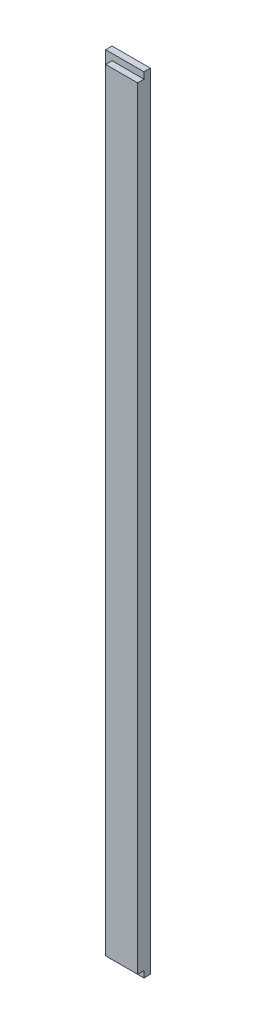
ISO-10303-21;
HEADER;
FILE_DESCRIPTION(('STEP AP214'),'2;1');
FILE_NAME('part.step','',(''),(''),'','','');
FILE_SCHEMA(('AUTOMOTIVE_DESIGN { 1 0 10303 214 1 1 1 1 }'));
ENDSEC;
DATA;
#1=APPLICATION_CONTEXT('core data for automotive mechanical design processes');
#2=APPLICATION_PROTOCOL_DEFINITION('international standard','automotive_design',2000,#1);
#3=PRODUCT_CONTEXT('',#1,'mechanical');
#4=PRODUCT('Part','Part','',(#3));
#5=PRODUCT_RELATED_PRODUCT_CATEGORY('part','',(#4));
#6=PRODUCT_DEFINITION_FORMATION('','',#4);
#7=PRODUCT_DEFINITION_CONTEXT('part definition',#1,'design');
#8=PRODUCT_DEFINITION('design','',#6,#7);
#9=PRODUCT_DEFINITION_SHAPE('','',#8);
#10=(LENGTH_UNIT() NAMED_UNIT(*) SI_UNIT(.MILLI.,.METRE.));
#11=(NAMED_UNIT(*) PLANE_ANGLE_UNIT() SI_UNIT($,.RADIAN.));
#12=(NAMED_UNIT(*) SI_UNIT($,.STERADIAN.) SOLID_ANGLE_UNIT());
#13=UNCERTAINTY_MEASURE_WITH_UNIT(LENGTH_MEASURE(1.E-05),#10,'distance_accuracy_value','');
#14=(GEOMETRIC_REPRESENTATION_CONTEXT(3) GLOBAL_UNCERTAINTY_ASSIGNED_CONTEXT((#13)) GLOBAL_UNIT_ASSIGNED_CONTEXT((#10,
#11,#12)) REPRESENTATION_CONTEXT('',''));
#15=CARTESIAN_POINT('',(0.,0.,0.));
#16=DIRECTION('',(0.,0.,1.));
#17=DIRECTION('',(1.,0.,0.));
#18=AXIS2_PLACEMENT_3D('',#15,#16,#17);
#19=CARTESIAN_POINT('',(-30.0000000000001,-615.,20.));
#20=DIRECTION('',(1.,0.,0.));
#21=DIRECTION('',(0.,0.,-1.));
#22=AXIS2_PLACEMENT_3D('',#19,#20,#21);
#23=PLANE('',#22);
#24=DIRECTION('',(0.,-1.,0.));
#25=VECTOR('',#24,1.);
#26=CARTESIAN_POINT('',(-30.0000000000001,615.,10.));
#27=LINE('',#26,#25);
#28=CARTESIAN_POINT('',(-30.0000000000001,615.,10.));
#29=VERTEX_POINT('',#28);
#30=CARTESIAN_POINT('',(-30.0000000000001,-615.,10.));
#31=VERTEX_POINT('',#30);
#32=EDGE_CURVE('E106',#29,#31,#27,.T.);
#33=ORIENTED_EDGE('',*,*,#32,.F.);
#34=DIRECTION('',(0.,0.,-1.));
#35=VECTOR('',#34,1.);
#36=CARTESIAN_POINT('',(-30.0000000000001,615.,20.));
#37=LINE('',#36,#35);
#38=CARTESIAN_POINT('',(-30.0000000000001,615.,0.));
#39=VERTEX_POINT('',#38);
#40=EDGE_CURVE('E61',#29,#39,#37,.T.);
#41=ORIENTED_EDGE('',*,*,#40,.T.);
#42=DIRECTION('',(0.,-1.,0.));
#43=VECTOR('',#42,1.);
#44=CARTESIAN_POINT('',(-30.0000000000001,-615.,0.));
#45=LINE('',#44,#43);
#46=CARTESIAN_POINT('',(-30.0000000000001,-615.,0.));
#47=VERTEX_POINT('',#46);
#48=EDGE_CURVE('E148',#39,#47,#45,.T.);
#49=ORIENTED_EDGE('',*,*,#48,.T.);
#50=DIRECTION('',(0.,0.,-1.));
#51=VECTOR('',#50,1.);
#52=CARTESIAN_POINT('',(-30.0000000000001,-615.,20.));
#53=LINE('',#52,#51);
#54=EDGE_CURVE('E11',#31,#47,#53,.T.);
#55=ORIENTED_EDGE('',*,*,#54,.F.);
#56=EDGE_LOOP('',(#33,#41,#49,#55));
#57=FACE_BOUND('',#56,.T.);
#58=ADVANCED_FACE('F39',(#57),#23,.F.);
#59=CARTESIAN_POINT('',(30.0000000000001,-615.,20.));
#60=DIRECTION('',(0.,1.,0.));
#61=DIRECTION('',(0.,0.,1.));
#62=AXIS2_PLACEMENT_3D('',#59,#60,#61);
#63=PLANE('',#62);
#64=DIRECTION('',(1.,0.,0.));
#65=VECTOR('',#64,1.);
#66=CARTESIAN_POINT('',(-30.0000000000001,-615.,10.));
#67=LINE('',#66,#65);
#68=CARTESIAN_POINT('',(30.0000000000001,-615.,10.));
#69=VERTEX_POINT('',#68);
#70=EDGE_CURVE('E117',#31,#69,#67,.T.);
#71=ORIENTED_EDGE('',*,*,#70,.F.);
#72=ORIENTED_EDGE('',*,*,#54,.T.);
#73=DIRECTION('',(1.,0.,0.));
#74=VECTOR('',#73,1.);
#75=CARTESIAN_POINT('',(30.0000000000001,-615.,0.));
#76=LINE('',#75,#74);
#77=CARTESIAN_POINT('',(30.0000000000001,-615.,0.));
#78=VERTEX_POINT('',#77);
#79=EDGE_CURVE('E145',#47,#78,#76,.T.);
#80=ORIENTED_EDGE('',*,*,#79,.T.);
#81=DIRECTION('',(0.,0.,-1.));
#82=VECTOR('',#81,1.);
#83=CARTESIAN_POINT('',(30.0000000000001,-615.,20.));
#84=LINE('',#83,#82);
#85=EDGE_CURVE('E46',#69,#78,#84,.T.);
#86=ORIENTED_EDGE('',*,*,#85,.F.);
#87=EDGE_LOOP('',(#71,#72,#80,#86));
#88=FACE_BOUND('',#87,.T.);
#89=ADVANCED_FACE('F146',(#88),#63,.F.);
#90=CARTESIAN_POINT('',(-30.0000000000001,615.,20.));
#91=DIRECTION('',(0.,-1.,0.));
#92=DIRECTION('',(0.,0.,-1.));
#93=AXIS2_PLACEMENT_3D('',#90,#91,#92);
#94=PLANE('',#93);
#95=DIRECTION('',(-1.,0.,0.));
#96=VECTOR('',#95,1.);
#97=CARTESIAN_POINT('',(30.0000000000001,615.,10.));
#98=LINE('',#97,#96);
#99=CARTESIAN_POINT('',(30.0000000000001,615.,10.));
#100=VERTEX_POINT('',#99);
#101=EDGE_CURVE('E104',#100,#29,#98,.T.);
#102=ORIENTED_EDGE('',*,*,#101,.F.);
#103=DIRECTION('',(0.,0.,-1.));
#104=VECTOR('',#103,1.);
#105=CARTESIAN_POINT('',(30.0000000000001,615.,20.));
#106=LINE('',#105,#104);
#107=CARTESIAN_POINT('',(30.0000000000001,615.,0.));
#108=VERTEX_POINT('',#107);
#109=EDGE_CURVE('E123',#100,#108,#106,.T.);
#110=ORIENTED_EDGE('',*,*,#109,.T.);
#111=DIRECTION('',(-1.,0.,0.));
#112=VECTOR('',#111,1.);
#113=CARTESIAN_POINT('',(-30.0000000000001,615.,0.));
#114=LINE('',#113,#112);
#115=EDGE_CURVE('E121',#108,#39,#114,.T.);
#116=ORIENTED_EDGE('',*,*,#115,.T.);
#117=ORIENTED_EDGE('',*,*,#40,.F.);
#118=EDGE_LOOP('',(#102,#110,#116,#117));
#119=FACE_BOUND('',#118,.T.);
#120=ADVANCED_FACE('F119',(#119),#94,.F.);
#121=CARTESIAN_POINT('',(30.0000000000001,615.,20.));
#122=DIRECTION('',(-1.,0.,0.));
#123=DIRECTION('',(0.,0.,1.));
#124=AXIS2_PLACEMENT_3D('',#121,#122,#123);
#125=PLANE('',#124);
#126=DIRECTION('',(0.,1.,0.));
#127=VECTOR('',#126,1.);
#128=CARTESIAN_POINT('',(30.0000000000001,615.,20.));
#129=LINE('',#128,#127);
#130=CARTESIAN_POINT('',(30.0000000000001,-605.,20.));
#131=VERTEX_POINT('',#130);
#132=CARTESIAN_POINT('',(30.0000000000001,605.,20.));
#133=VERTEX_POINT('',#132);
#134=EDGE_CURVE('E124',#131,#133,#129,.T.);
#135=ORIENTED_EDGE('',*,*,#134,.F.);
#136=DIRECTION('',(0.,0.,1.));
#137=VECTOR('',#136,1.);
#138=CARTESIAN_POINT('',(30.0000000000001,-605.,10.));
#139=LINE('',#138,#137);
#140=CARTESIAN_POINT('',(30.0000000000001,-605.,10.));
#141=VERTEX_POINT('',#140);
#142=EDGE_CURVE('E53',#141,#131,#139,.T.);
#143=ORIENTED_EDGE('',*,*,#142,.F.);
#144=DIRECTION('',(0.,1.,0.));
#145=VECTOR('',#144,1.);
#146=CARTESIAN_POINT('',(30.0000000000001,-615.,10.));
#147=LINE('',#146,#145);
#148=EDGE_CURVE('E142',#69,#141,#147,.T.);
#149=ORIENTED_EDGE('',*,*,#148,.F.);
#150=ORIENTED_EDGE('',*,*,#85,.T.);
#151=DIRECTION('',(0.,1.,0.));
#152=VECTOR('',#151,1.);
#153=CARTESIAN_POINT('',(30.0000000000001,615.,0.));
#154=LINE('',#153,#152);
#155=EDGE_CURVE('E140',#78,#108,#154,.T.);
#156=ORIENTED_EDGE('',*,*,#155,.T.);
#157=ORIENTED_EDGE('',*,*,#109,.F.);
#158=DIRECTION('',(0.,1.,0.));
#159=VECTOR('',#158,1.);
#160=CARTESIAN_POINT('',(30.0000000000001,605.,10.));
#161=LINE('',#160,#159);
#162=CARTESIAN_POINT('',(30.0000000000001,605.,10.));
#163=VERTEX_POINT('',#162);
#164=EDGE_CURVE('E110',#163,#100,#161,.T.);
#165=ORIENTED_EDGE('',*,*,#164,.F.);
#166=DIRECTION('',(0.,0.,1.));
#167=VECTOR('',#166,1.);
#168=CARTESIAN_POINT('',(30.0000000000001,605.,10.));
#169=LINE('',#168,#167);
#170=EDGE_CURVE('E154',#163,#133,#169,.T.);
#171=ORIENTED_EDGE('',*,*,#170,.T.);
#172=EDGE_LOOP('',(#135,#143,#149,#150,#156,#157,#165,#171));
#173=FACE_BOUND('',#172,.T.);
#174=ADVANCED_FACE('F138',(#173),#125,.F.);
#175=CARTESIAN_POINT('',(0.,0.,20.));
#176=DIRECTION('',(0.,0.,-1.));
#177=DIRECTION('',(-1.,0.,0.));
#178=AXIS2_PLACEMENT_3D('',#175,#176,#177);
#179=PLANE('',#178);
#180=ORIENTED_EDGE('',*,*,#134,.T.);
#181=DIRECTION('',(1.,0.,0.));
#182=VECTOR('',#181,1.);
#183=CARTESIAN_POINT('',(30.0000000000001,605.,20.));
#184=LINE('',#183,#182);
#185=CARTESIAN_POINT('',(-20.0000000000001,605.,20.));
#186=VERTEX_POINT('',#185);
#187=EDGE_CURVE('E113',#186,#133,#184,.T.);
#188=ORIENTED_EDGE('',*,*,#187,.F.);
#189=DIRECTION('',(0.,1.,0.));
#190=VECTOR('',#189,1.);
#191=CARTESIAN_POINT('',(-20.0000000000001,605.,20.));
#192=LINE('',#191,#190);
#193=CARTESIAN_POINT('',(-20.,-605.,20.));
#194=VERTEX_POINT('',#193);
#195=EDGE_CURVE('E164',#194,#186,#192,.T.);
#196=ORIENTED_EDGE('',*,*,#195,.F.);
#197=DIRECTION('',(-1.,0.,0.));
#198=VECTOR('',#197,1.);
#199=CARTESIAN_POINT('',(-20.,-605.,20.));
#200=LINE('',#199,#198);
#201=EDGE_CURVE('E168',#131,#194,#200,.T.);
#202=ORIENTED_EDGE('',*,*,#201,.F.);
#203=EDGE_LOOP('',(#180,#188,#196,#202));
#204=FACE_BOUND('',#203,.T.);
#205=ADVANCED_FACE('F183',(#204),#179,.F.);
#206=CARTESIAN_POINT('',(0.,0.,0.));
#207=DIRECTION('',(0.,0.,-1.));
#208=DIRECTION('',(-1.,0.,0.));
#209=AXIS2_PLACEMENT_3D('',#206,#207,#208);
#210=PLANE('',#209);
#211=ORIENTED_EDGE('',*,*,#48,.F.);
#212=ORIENTED_EDGE('',*,*,#115,.F.);
#213=ORIENTED_EDGE('',*,*,#155,.F.);
#214=ORIENTED_EDGE('',*,*,#79,.F.);
#215=EDGE_LOOP('',(#211,#212,#213,#214));
#216=FACE_BOUND('',#215,.T.);
#217=ADVANCED_FACE('F150',(#216),#210,.T.);
#218=CARTESIAN_POINT('',(30.0000000000001,605.,10.));
#219=DIRECTION('',(0.,-1.,0.));
#220=DIRECTION('',(0.,0.,-1.));
#221=AXIS2_PLACEMENT_3D('',#218,#219,#220);
#222=PLANE('',#221);
#223=ORIENTED_EDGE('',*,*,#187,.T.);
#224=ORIENTED_EDGE('',*,*,#170,.F.);
#225=DIRECTION('',(1.,0.,0.));
#226=VECTOR('',#225,1.);
#227=CARTESIAN_POINT('',(30.0000000000001,605.,10.));
#228=LINE('',#227,#226);
#229=CARTESIAN_POINT('',(-20.0000000000001,605.,10.));
#230=VERTEX_POINT('',#229);
#231=EDGE_CURVE('E171',#230,#163,#228,.T.);
#232=ORIENTED_EDGE('',*,*,#231,.F.);
#233=DIRECTION('',(0.,0.,1.));
#234=VECTOR('',#233,1.);
#235=CARTESIAN_POINT('',(-20.0000000000001,605.,10.));
#236=LINE('',#235,#234);
#237=EDGE_CURVE('E159',#230,#186,#236,.T.);
#238=ORIENTED_EDGE('',*,*,#237,.T.);
#239=EDGE_LOOP('',(#223,#224,#232,#238));
#240=FACE_BOUND('',#239,.T.);
#241=ADVANCED_FACE('F191',(#240),#222,.F.);
#242=CARTESIAN_POINT('',(-20.0000000000001,605.,10.));
#243=DIRECTION('',(1.,0.,0.));
#244=DIRECTION('',(0.,1.,0.));
#245=AXIS2_PLACEMENT_3D('',#242,#243,#244);
#246=PLANE('',#245);
#247=ORIENTED_EDGE('',*,*,#195,.T.);
#248=ORIENTED_EDGE('',*,*,#237,.F.);
#249=DIRECTION('',(0.,1.,0.));
#250=VECTOR('',#249,1.);
#251=CARTESIAN_POINT('',(-20.0000000000001,605.,10.));
#252=LINE('',#251,#250);
#253=CARTESIAN_POINT('',(-20.,-605.,10.));
#254=VERTEX_POINT('',#253);
#255=EDGE_CURVE('E173',#254,#230,#252,.T.);
#256=ORIENTED_EDGE('',*,*,#255,.F.);
#257=DIRECTION('',(0.,0.,1.));
#258=VECTOR('',#257,1.);
#259=CARTESIAN_POINT('',(-20.,-605.,10.));
#260=LINE('',#259,#258);
#261=EDGE_CURVE('E157',#254,#194,#260,.T.);
#262=ORIENTED_EDGE('',*,*,#261,.T.);
#263=EDGE_LOOP('',(#247,#248,#256,#262));
#264=FACE_BOUND('',#263,.T.);
#265=ADVANCED_FACE('F188',(#264),#246,.F.);
#266=CARTESIAN_POINT('',(-20.,-605.,10.));
#267=DIRECTION('',(0.,1.,0.));
#268=DIRECTION('',(0.,0.,1.));
#269=AXIS2_PLACEMENT_3D('',#266,#267,#268);
#270=PLANE('',#269);
#271=ORIENTED_EDGE('',*,*,#201,.T.);
#272=ORIENTED_EDGE('',*,*,#261,.F.);
#273=DIRECTION('',(-1.,0.,0.));
#274=VECTOR('',#273,1.);
#275=CARTESIAN_POINT('',(-20.,-605.,10.));
#276=LINE('',#275,#274);
#277=EDGE_CURVE('E177',#141,#254,#276,.T.);
#278=ORIENTED_EDGE('',*,*,#277,.F.);
#279=ORIENTED_EDGE('',*,*,#142,.T.);
#280=EDGE_LOOP('',(#271,#272,#278,#279));
#281=FACE_BOUND('',#280,.T.);
#282=ADVANCED_FACE('F185',(#281),#270,.F.);
#283=CARTESIAN_POINT('',(0.,0.,10.));
#284=DIRECTION('',(0.,0.,1.));
#285=DIRECTION('',(1.,0.,0.));
#286=AXIS2_PLACEMENT_3D('',#283,#284,#285);
#287=PLANE('',#286);
#288=ORIENTED_EDGE('',*,*,#101,.T.);
#289=ORIENTED_EDGE('',*,*,#32,.T.);
#290=ORIENTED_EDGE('',*,*,#70,.T.);
#291=ORIENTED_EDGE('',*,*,#148,.T.);
#292=ORIENTED_EDGE('',*,*,#277,.T.);
#293=ORIENTED_EDGE('',*,*,#255,.T.);
#294=ORIENTED_EDGE('',*,*,#231,.T.);
#295=ORIENTED_EDGE('',*,*,#164,.T.);
#296=EDGE_LOOP('',(#288,#289,#290,#291,#292,#293,#294,#295));
#297=FACE_BOUND('',#296,.T.);
#298=ADVANCED_FACE('F105',(#297),#287,.T.);
#299=CLOSED_SHELL('',(#58,#89,#120,#174,#205,#217,#241,#265,#282,#298));
#300=MANIFOLD_SOLID_BREP('B2',#299);
#301=ADVANCED_BREP_SHAPE_REPRESENTATION('',(#18,#300),#14);
#302=SHAPE_DEFINITION_REPRESENTATION(#9,#301);
ENDSEC;
END-ISO-10303-21;
